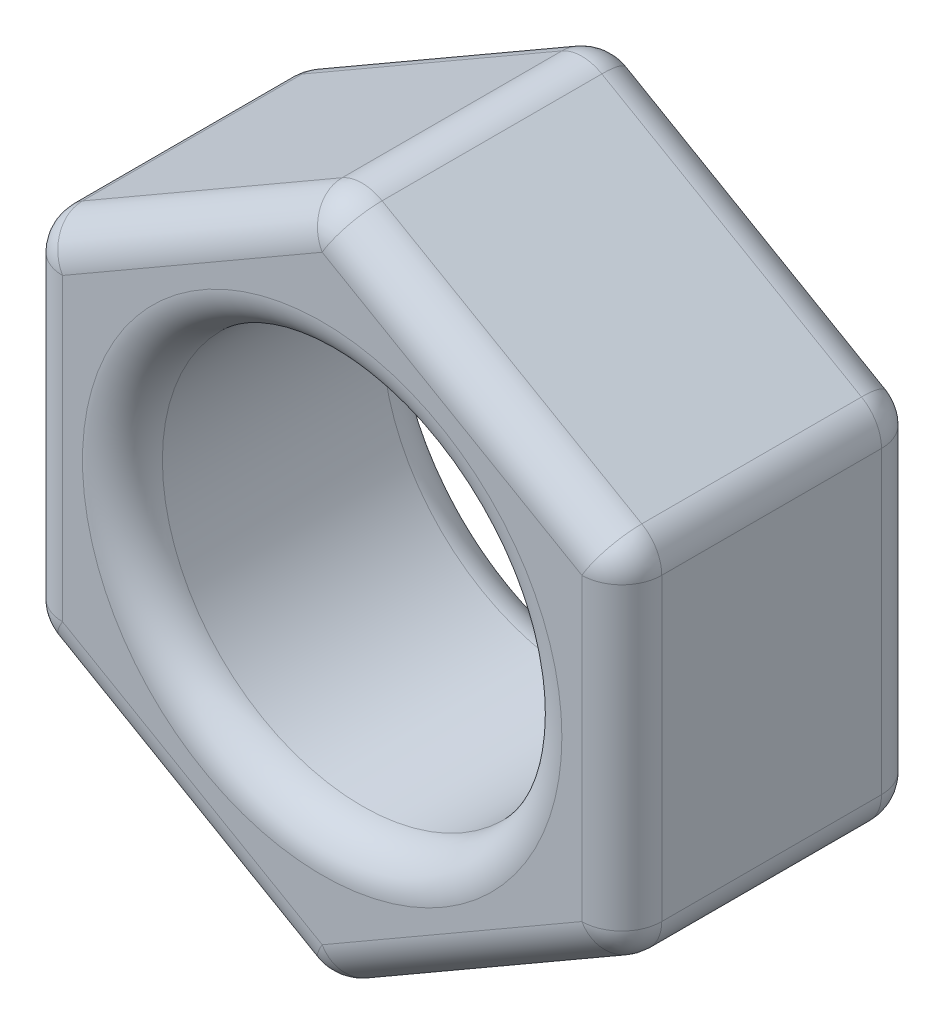
ISO-10303-21;
HEADER;
FILE_DESCRIPTION(('STEP AP214'),'2;1');
FILE_NAME('part.step','',(''),(''),'','','');
FILE_SCHEMA(('AUTOMOTIVE_DESIGN { 1 0 10303 214 1 1 1 1 }'));
ENDSEC;
DATA;
#1=APPLICATION_CONTEXT('core data for automotive mechanical design processes');
#2=APPLICATION_PROTOCOL_DEFINITION('international standard','automotive_design',2000,#1);
#3=PRODUCT_CONTEXT('',#1,'mechanical');
#4=PRODUCT('Part','Part','',(#3));
#5=PRODUCT_RELATED_PRODUCT_CATEGORY('part','',(#4));
#6=PRODUCT_DEFINITION_FORMATION('','',#4);
#7=PRODUCT_DEFINITION_CONTEXT('part definition',#1,'design');
#8=PRODUCT_DEFINITION('design','',#6,#7);
#9=PRODUCT_DEFINITION_SHAPE('','',#8);
#10=(LENGTH_UNIT() NAMED_UNIT(*) SI_UNIT(.MILLI.,.METRE.));
#11=(NAMED_UNIT(*) PLANE_ANGLE_UNIT() SI_UNIT($,.RADIAN.));
#12=(NAMED_UNIT(*) SI_UNIT($,.STERADIAN.) SOLID_ANGLE_UNIT());
#13=UNCERTAINTY_MEASURE_WITH_UNIT(LENGTH_MEASURE(1.E-05),#10,'distance_accuracy_value','');
#14=(GEOMETRIC_REPRESENTATION_CONTEXT(3) GLOBAL_UNCERTAINTY_ASSIGNED_CONTEXT((#13)) GLOBAL_UNIT_ASSIGNED_CONTEXT((#10,
#11,#12)) REPRESENTATION_CONTEXT('',''));
#15=CARTESIAN_POINT('',(0.,0.,0.));
#16=DIRECTION('',(0.,0.,1.));
#17=DIRECTION('',(1.,0.,0.));
#18=AXIS2_PLACEMENT_3D('',#15,#16,#17);
#19=CARTESIAN_POINT('',(0.,-1.73205080756889,1.5));
#20=DIRECTION('',(0.,0.,1.));
#21=DIRECTION('',(1.,0.,0.));
#22=AXIS2_PLACEMENT_3D('',#19,#20,#21);
#23=PLANE('',#22);
#24=DIRECTION('',(-0.866025403784439,0.5,0.));
#25=VECTOR('',#24,1.);
#26=CARTESIAN_POINT('',(-0.0999999999999946,1.55884572681201,1.5));
#27=LINE('',#26,#25);
#28=CARTESIAN_POINT('',(1.30000000000001,0.750555349946526,1.5));
#29=VERTEX_POINT('',#28);
#30=CARTESIAN_POINT('',(0.,1.50111069989304,1.5));
#31=VERTEX_POINT('',#30);
#32=EDGE_CURVE('E204',#29,#31,#27,.T.);
#33=ORIENTED_EDGE('',*,*,#32,.T.);
#34=DIRECTION('',(-0.866025403784439,-0.5,0.));
#35=VECTOR('',#34,1.);
#36=CARTESIAN_POINT('',(-1.40000000000001,0.692820323027558,1.5));
#37=LINE('',#36,#35);
#38=CARTESIAN_POINT('',(-1.30000000000001,0.75055534994652,1.5));
#39=VERTEX_POINT('',#38);
#40=EDGE_CURVE('E176',#31,#39,#37,.T.);
#41=ORIENTED_EDGE('',*,*,#40,.T.);
#42=DIRECTION('',(0.,-1.,0.));
#43=VECTOR('',#42,1.);
#44=CARTESIAN_POINT('',(-1.30000000000001,-0.866025403784445,1.5));
#45=LINE('',#44,#43);
#46=CARTESIAN_POINT('',(-1.30000000000001,-0.75055534994652,1.5));
#47=VERTEX_POINT('',#46);
#48=EDGE_CURVE('E193',#39,#47,#45,.T.);
#49=ORIENTED_EDGE('',*,*,#48,.T.);
#50=DIRECTION('',(0.866025403784439,-0.5,0.));
#51=VECTOR('',#50,1.);
#52=CARTESIAN_POINT('',(0.1,-1.55884572681201,1.5));
#53=LINE('',#52,#51);
#54=CARTESIAN_POINT('',(0.,-1.50111069989304,1.5));
#55=VERTEX_POINT('',#54);
#56=EDGE_CURVE('E199',#47,#55,#53,.T.);
#57=ORIENTED_EDGE('',*,*,#56,.T.);
#58=DIRECTION('',(0.866025403784439,0.5,0.));
#59=VECTOR('',#58,1.);
#60=CARTESIAN_POINT('',(1.40000000000002,-0.692820323027558,1.5));
#61=LINE('',#60,#59);
#62=CARTESIAN_POINT('',(1.30000000000001,-0.750555349946521,1.5));
#63=VERTEX_POINT('',#62);
#64=EDGE_CURVE('E376',#55,#63,#61,.T.);
#65=ORIENTED_EDGE('',*,*,#64,.T.);
#66=DIRECTION('',(0.,1.,0.));
#67=VECTOR('',#66,1.);
#68=CARTESIAN_POINT('',(1.30000000000001,0.866025403784451,1.5));
#69=LINE('',#68,#67);
#70=EDGE_CURVE('E210',#63,#29,#69,.T.);
#71=ORIENTED_EDGE('',*,*,#70,.T.);
#72=EDGE_LOOP('',(#33,#41,#49,#57,#65,#71));
#73=FACE_BOUND('',#72,.T.);
#74=CARTESIAN_POINT('',(0.,0.,1.5));
#75=DIRECTION('',(0.,0.,1.));
#76=DIRECTION('',(1.,0.,0.));
#77=AXIS2_PLACEMENT_3D('',#74,#75,#76);
#78=CIRCLE('',#77,1.2);
#79=CARTESIAN_POINT('',(1.2,0.,1.5));
#80=VERTEX_POINT('',#79);
#81=EDGE_CURVE('E200',#80,#80,#78,.F.);
#82=ORIENTED_EDGE('',*,*,#81,.T.);
#83=EDGE_LOOP('',(#82));
#84=FACE_BOUND('',#83,.T.);
#85=ADVANCED_FACE('F44',(#73,#84),#23,.T.);
#86=CARTESIAN_POINT('',(0.,-1.73205080756889,0.));
#87=DIRECTION('',(0.,0.,1.));
#88=DIRECTION('',(1.,0.,0.));
#89=AXIS2_PLACEMENT_3D('',#86,#87,#88);
#90=PLANE('',#89);
#91=DIRECTION('',(0.,-1.,0.));
#92=VECTOR('',#91,1.);
#93=CARTESIAN_POINT('',(-1.30000000000001,-1.73205080756889,0.));
#94=LINE('',#93,#92);
#95=CARTESIAN_POINT('',(-1.30000000000001,-0.75055534994652,0.));
#96=VERTEX_POINT('',#95);
#97=CARTESIAN_POINT('',(-1.30000000000001,0.75055534994652,0.));
#98=VERTEX_POINT('',#97);
#99=EDGE_CURVE('E221',#96,#98,#94,.F.);
#100=ORIENTED_EDGE('',*,*,#99,.T.);
#101=DIRECTION('',(-0.866025403784439,-0.5,0.));
#102=VECTOR('',#101,1.);
#103=CARTESIAN_POINT('',(-1.40000000000001,0.692820323027559,0.));
#104=LINE('',#103,#102);
#105=CARTESIAN_POINT('',(0.,1.50111069989304,0.));
#106=VERTEX_POINT('',#105);
#107=EDGE_CURVE('E231',#98,#106,#104,.F.);
#108=ORIENTED_EDGE('',*,*,#107,.T.);
#109=DIRECTION('',(-0.866025403784439,0.5,0.));
#110=VECTOR('',#109,1.);
#111=CARTESIAN_POINT('',(1.40000000000002,0.692820323027562,0.));
#112=LINE('',#111,#110);
#113=CARTESIAN_POINT('',(1.30000000000001,0.750555349946525,0.));
#114=VERTEX_POINT('',#113);
#115=EDGE_CURVE('E229',#106,#114,#112,.F.);
#116=ORIENTED_EDGE('',*,*,#115,.T.);
#117=DIRECTION('',(0.,1.,0.));
#118=VECTOR('',#117,1.);
#119=CARTESIAN_POINT('',(1.30000000000002,-1.73205080756889,0.));
#120=LINE('',#119,#118);
#121=CARTESIAN_POINT('',(1.30000000000001,-0.750555349946521,0.));
#122=VERTEX_POINT('',#121);
#123=EDGE_CURVE('E227',#114,#122,#120,.F.);
#124=ORIENTED_EDGE('',*,*,#123,.T.);
#125=DIRECTION('',(0.866025403784439,0.5,0.));
#126=VECTOR('',#125,1.);
#127=CARTESIAN_POINT('',(-0.1,-1.55884572681201,0.));
#128=LINE('',#127,#126);
#129=CARTESIAN_POINT('',(0.,-1.50111069989304,0.));
#130=VERTEX_POINT('',#129);
#131=EDGE_CURVE('E225',#122,#130,#128,.F.);
#132=ORIENTED_EDGE('',*,*,#131,.T.);
#133=DIRECTION('',(0.866025403784439,-0.5,0.));
#134=VECTOR('',#133,1.);
#135=CARTESIAN_POINT('',(0.0999999999999999,-1.55884572681201,0.));
#136=LINE('',#135,#134);
#137=EDGE_CURVE('E223',#130,#96,#136,.F.);
#138=ORIENTED_EDGE('',*,*,#137,.T.);
#139=EDGE_LOOP('',(#100,#108,#116,#124,#132,#138));
#140=FACE_BOUND('',#139,.T.);
#141=CARTESIAN_POINT('',(0.,0.,0.));
#142=DIRECTION('',(0.,0.,1.));
#143=DIRECTION('',(1.,0.,0.));
#144=AXIS2_PLACEMENT_3D('',#141,#142,#143);
#145=CIRCLE('',#144,1.2);
#146=CARTESIAN_POINT('',(1.2,0.,0.));
#147=VERTEX_POINT('',#146);
#148=EDGE_CURVE('E218',#147,#147,#145,.T.);
#149=ORIENTED_EDGE('',*,*,#148,.T.);
#150=EDGE_LOOP('',(#149));
#151=FACE_BOUND('',#150,.T.);
#152=ADVANCED_FACE('F464',(#140,#151),#90,.F.);
#153=CARTESIAN_POINT('',(-1.50000000000001,-0.866025403784445,1.5));
#154=DIRECTION('',(0.5,0.866025403784438,0.));
#155=DIRECTION('',(-0.866025403784439,0.5,0.));
#156=AXIS2_PLACEMENT_3D('',#153,#154,#155);
#157=PLANE('',#156);
#158=DIRECTION('',(0.,0.,-1.));
#159=VECTOR('',#158,1.);
#160=CARTESIAN_POINT('',(-0.0999999999999998,-1.67431578064993,1.5));
#161=LINE('',#160,#159);
#162=CARTESIAN_POINT('',(-0.1,-1.67431578064993,0.2));
#163=VERTEX_POINT('',#162);
#164=CARTESIAN_POINT('',(-0.1,-1.67431578064993,1.3));
#165=VERTEX_POINT('',#164);
#166=EDGE_CURVE('E265',#163,#165,#161,.F.);
#167=ORIENTED_EDGE('',*,*,#166,.T.);
#168=DIRECTION('',(0.866025403784439,-0.5,0.));
#169=VECTOR('',#168,1.);
#170=CARTESIAN_POINT('',(-1.50000000000001,-0.866025403784445,1.3));
#171=LINE('',#170,#169);
#172=CARTESIAN_POINT('',(-1.40000000000001,-0.923760430703408,1.3));
#173=VERTEX_POINT('',#172);
#174=EDGE_CURVE('E267',#165,#173,#171,.F.);
#175=ORIENTED_EDGE('',*,*,#174,.T.);
#176=DIRECTION('',(0.,0.,-1.));
#177=VECTOR('',#176,1.);
#178=CARTESIAN_POINT('',(-1.40000000000001,-0.923760430703408,1.5));
#179=LINE('',#178,#177);
#180=CARTESIAN_POINT('',(-1.40000000000001,-0.923760430703408,0.2));
#181=VERTEX_POINT('',#180);
#182=EDGE_CURVE('E261',#173,#181,#179,.T.);
#183=ORIENTED_EDGE('',*,*,#182,.T.);
#184=DIRECTION('',(0.866025403784439,-0.5,0.));
#185=VECTOR('',#184,1.);
#186=CARTESIAN_POINT('',(-1.50000000000001,-0.866025403784445,0.2));
#187=LINE('',#186,#185);
#188=EDGE_CURVE('E263',#181,#163,#187,.T.);
#189=ORIENTED_EDGE('',*,*,#188,.T.);
#190=EDGE_LOOP('',(#167,#175,#183,#189));
#191=FACE_BOUND('',#190,.T.);
#192=ADVANCED_FACE('F469',(#191),#157,.F.);
#193=CARTESIAN_POINT('',(0.,-1.73205080756889,1.5));
#194=DIRECTION('',(-0.5,0.866025403784439,0.));
#195=DIRECTION('',(-0.866025403784439,-0.5,0.));
#196=AXIS2_PLACEMENT_3D('',#193,#194,#195);
#197=PLANE('',#196);
#198=DIRECTION('',(0.,0.,-1.));
#199=VECTOR('',#198,1.);
#200=CARTESIAN_POINT('',(1.40000000000001,-0.923760430703409,1.5));
#201=LINE('',#200,#199);
#202=CARTESIAN_POINT('',(1.40000000000001,-0.923760430703409,0.2));
#203=VERTEX_POINT('',#202);
#204=CARTESIAN_POINT('',(1.40000000000001,-0.923760430703409,1.3));
#205=VERTEX_POINT('',#204);
#206=EDGE_CURVE('E256',#203,#205,#201,.F.);
#207=ORIENTED_EDGE('',*,*,#206,.T.);
#208=DIRECTION('',(0.866025403784439,0.5,0.));
#209=VECTOR('',#208,1.);
#210=CARTESIAN_POINT('',(0.,-1.73205080756889,1.3));
#211=LINE('',#210,#209);
#212=CARTESIAN_POINT('',(0.0999999999999999,-1.67431578064993,1.3));
#213=VERTEX_POINT('',#212);
#214=EDGE_CURVE('E258',#205,#213,#211,.F.);
#215=ORIENTED_EDGE('',*,*,#214,.T.);
#216=DIRECTION('',(0.,0.,-1.));
#217=VECTOR('',#216,1.);
#218=CARTESIAN_POINT('',(0.0999999999999999,-1.67431578064993,1.5));
#219=LINE('',#218,#217);
#220=CARTESIAN_POINT('',(0.0999999999999999,-1.67431578064993,0.2));
#221=VERTEX_POINT('',#220);
#222=EDGE_CURVE('E252',#213,#221,#219,.T.);
#223=ORIENTED_EDGE('',*,*,#222,.T.);
#224=DIRECTION('',(0.866025403784439,0.5,0.));
#225=VECTOR('',#224,1.);
#226=CARTESIAN_POINT('',(0.,-1.73205080756889,0.2));
#227=LINE('',#226,#225);
#228=EDGE_CURVE('E254',#221,#203,#227,.T.);
#229=ORIENTED_EDGE('',*,*,#228,.T.);
#230=EDGE_LOOP('',(#207,#215,#223,#229));
#231=FACE_BOUND('',#230,.T.);
#232=ADVANCED_FACE('F444',(#231),#197,.F.);
#233=CARTESIAN_POINT('',(1.50000000000002,-0.866025403784446,1.5));
#234=DIRECTION('',(-1.,0.,0.));
#235=DIRECTION('',(0.,-1.,0.));
#236=AXIS2_PLACEMENT_3D('',#233,#234,#235);
#237=PLANE('',#236);
#238=DIRECTION('',(0.,0.,-1.));
#239=VECTOR('',#238,1.);
#240=CARTESIAN_POINT('',(1.50000000000001,0.750555349946526,1.5));
#241=LINE('',#240,#239);
#242=CARTESIAN_POINT('',(1.50000000000001,0.750555349946526,0.2));
#243=VERTEX_POINT('',#242);
#244=CARTESIAN_POINT('',(1.50000000000001,0.750555349946526,1.3));
#245=VERTEX_POINT('',#244);
#246=EDGE_CURVE('E247',#243,#245,#241,.F.);
#247=ORIENTED_EDGE('',*,*,#246,.T.);
#248=DIRECTION('',(0.,1.,0.));
#249=VECTOR('',#248,1.);
#250=CARTESIAN_POINT('',(1.50000000000002,-0.866025403784446,1.3));
#251=LINE('',#250,#249);
#252=CARTESIAN_POINT('',(1.50000000000002,-0.750555349946521,1.3));
#253=VERTEX_POINT('',#252);
#254=EDGE_CURVE('E249',#245,#253,#251,.F.);
#255=ORIENTED_EDGE('',*,*,#254,.T.);
#256=DIRECTION('',(0.,0.,-1.));
#257=VECTOR('',#256,1.);
#258=CARTESIAN_POINT('',(1.50000000000002,-0.750555349946521,1.5));
#259=LINE('',#258,#257);
#260=CARTESIAN_POINT('',(1.50000000000002,-0.750555349946521,0.2));
#261=VERTEX_POINT('',#260);
#262=EDGE_CURVE('E243',#253,#261,#259,.T.);
#263=ORIENTED_EDGE('',*,*,#262,.T.);
#264=DIRECTION('',(0.,1.,0.));
#265=VECTOR('',#264,1.);
#266=CARTESIAN_POINT('',(1.50000000000002,-0.866025403784446,0.2));
#267=LINE('',#266,#265);
#268=EDGE_CURVE('E245',#261,#243,#267,.T.);
#269=ORIENTED_EDGE('',*,*,#268,.T.);
#270=EDGE_LOOP('',(#247,#255,#263,#269));
#271=FACE_BOUND('',#270,.T.);
#272=ADVANCED_FACE('F482',(#271),#237,.F.);
#273=CARTESIAN_POINT('',(1.50000000000001,0.866025403784451,1.5));
#274=DIRECTION('',(-0.5,-0.866025403784439,0.));
#275=DIRECTION('',(0.866025403784439,-0.5,0.));
#276=AXIS2_PLACEMENT_3D('',#273,#274,#275);
#277=PLANE('',#276);
#278=DIRECTION('',(0.,0.,-1.));
#279=VECTOR('',#278,1.);
#280=CARTESIAN_POINT('',(0.100000000000005,1.67431578064993,1.5));
#281=LINE('',#280,#279);
#282=CARTESIAN_POINT('',(0.100000000000005,1.67431578064993,0.2));
#283=VERTEX_POINT('',#282);
#284=CARTESIAN_POINT('',(0.100000000000005,1.67431578064993,1.3));
#285=VERTEX_POINT('',#284);
#286=EDGE_CURVE('E238',#283,#285,#281,.F.);
#287=ORIENTED_EDGE('',*,*,#286,.T.);
#288=DIRECTION('',(-0.866025403784439,0.5,0.));
#289=VECTOR('',#288,1.);
#290=CARTESIAN_POINT('',(1.50000000000001,0.866025403784451,1.3));
#291=LINE('',#290,#289);
#292=CARTESIAN_POINT('',(1.40000000000001,0.923760430703413,1.3));
#293=VERTEX_POINT('',#292);
#294=EDGE_CURVE('E240',#285,#293,#291,.F.);
#295=ORIENTED_EDGE('',*,*,#294,.T.);
#296=DIRECTION('',(0.,0.,-1.));
#297=VECTOR('',#296,1.);
#298=CARTESIAN_POINT('',(1.40000000000001,0.923760430703413,1.5));
#299=LINE('',#298,#297);
#300=CARTESIAN_POINT('',(1.40000000000001,0.923760430703413,0.2));
#301=VERTEX_POINT('',#300);
#302=EDGE_CURVE('E234',#293,#301,#299,.T.);
#303=ORIENTED_EDGE('',*,*,#302,.T.);
#304=DIRECTION('',(-0.866025403784439,0.5,0.));
#305=VECTOR('',#304,1.);
#306=CARTESIAN_POINT('',(1.50000000000001,0.866025403784451,0.2));
#307=LINE('',#306,#305);
#308=EDGE_CURVE('E236',#301,#283,#307,.T.);
#309=ORIENTED_EDGE('',*,*,#308,.T.);
#310=EDGE_LOOP('',(#287,#295,#303,#309));
#311=FACE_BOUND('',#310,.T.);
#312=ADVANCED_FACE('F479',(#311),#277,.F.);
#313=CARTESIAN_POINT('',(0.,1.73205080756889,1.5));
#314=DIRECTION('',(0.5,-0.866025403784439,0.));
#315=DIRECTION('',(0.866025403784439,0.5,0.));
#316=AXIS2_PLACEMENT_3D('',#313,#314,#315);
#317=PLANE('',#316);
#318=DIRECTION('',(-0.866025403784439,-0.5,0.));
#319=VECTOR('',#318,1.);
#320=CARTESIAN_POINT('',(0.,1.73205080756889,1.3));
#321=LINE('',#320,#319);
#322=CARTESIAN_POINT('',(-1.40000000000001,0.923760430703408,1.3));
#323=VERTEX_POINT('',#322);
#324=CARTESIAN_POINT('',(-0.0999999999999947,1.67431578064993,1.3));
#325=VERTEX_POINT('',#324);
#326=EDGE_CURVE('E178',#323,#325,#321,.F.);
#327=ORIENTED_EDGE('',*,*,#326,.T.);
#328=DIRECTION('',(0.,0.,-1.));
#329=VECTOR('',#328,1.);
#330=CARTESIAN_POINT('',(-0.0999999999999947,1.67431578064993,1.5));
#331=LINE('',#330,#329);
#332=CARTESIAN_POINT('',(-0.0999999999999947,1.67431578064993,0.2));
#333=VERTEX_POINT('',#332);
#334=EDGE_CURVE('E216',#325,#333,#331,.T.);
#335=ORIENTED_EDGE('',*,*,#334,.T.);
#336=DIRECTION('',(-0.866025403784439,-0.5,0.));
#337=VECTOR('',#336,1.);
#338=CARTESIAN_POINT('',(0.,1.73205080756889,0.2));
#339=LINE('',#338,#337);
#340=CARTESIAN_POINT('',(-1.40000000000001,0.923760430703408,0.2));
#341=VERTEX_POINT('',#340);
#342=EDGE_CURVE('E208',#333,#341,#339,.T.);
#343=ORIENTED_EDGE('',*,*,#342,.T.);
#344=DIRECTION('',(0.,0.,-1.));
#345=VECTOR('',#344,1.);
#346=CARTESIAN_POINT('',(-1.40000000000001,0.923760430703408,1.5));
#347=LINE('',#346,#345);
#348=EDGE_CURVE('E206',#341,#323,#347,.F.);
#349=ORIENTED_EDGE('',*,*,#348,.T.);
#350=EDGE_LOOP('',(#327,#335,#343,#349));
#351=FACE_BOUND('',#350,.T.);
#352=ADVANCED_FACE('F403',(#351),#317,.F.);
#353=CARTESIAN_POINT('',(-1.50000000000001,0.866025403784445,1.5));
#354=DIRECTION('',(1.,0.,0.));
#355=DIRECTION('',(0.,0.,-1.));
#356=AXIS2_PLACEMENT_3D('',#353,#354,#355);
#357=PLANE('',#356);
#358=DIRECTION('',(0.,-1.,0.));
#359=VECTOR('',#358,1.);
#360=CARTESIAN_POINT('',(-1.50000000000001,0.866025403784445,1.3));
#361=LINE('',#360,#359);
#362=CARTESIAN_POINT('',(-1.50000000000001,-0.75055534994652,1.3));
#363=VERTEX_POINT('',#362);
#364=CARTESIAN_POINT('',(-1.50000000000001,0.75055534994652,1.3));
#365=VERTEX_POINT('',#364);
#366=EDGE_CURVE('E61',#363,#365,#361,.F.);
#367=ORIENTED_EDGE('',*,*,#366,.T.);
#368=DIRECTION('',(0.,0.,-1.));
#369=VECTOR('',#368,1.);
#370=CARTESIAN_POINT('',(-1.50000000000001,0.75055534994652,1.5));
#371=LINE('',#370,#369);
#372=CARTESIAN_POINT('',(-1.50000000000001,0.75055534994652,0.2));
#373=VERTEX_POINT('',#372);
#374=EDGE_CURVE('E274',#365,#373,#371,.T.);
#375=ORIENTED_EDGE('',*,*,#374,.T.);
#376=DIRECTION('',(0.,-1.,0.));
#377=VECTOR('',#376,1.);
#378=CARTESIAN_POINT('',(-1.50000000000001,0.866025403784445,0.2));
#379=LINE('',#378,#377);
#380=CARTESIAN_POINT('',(-1.50000000000001,-0.75055534994652,0.2));
#381=VERTEX_POINT('',#380);
#382=EDGE_CURVE('E270',#373,#381,#379,.T.);
#383=ORIENTED_EDGE('',*,*,#382,.T.);
#384=DIRECTION('',(0.,0.,-1.));
#385=VECTOR('',#384,1.);
#386=CARTESIAN_POINT('',(-1.50000000000001,-0.750555349946521,1.5));
#387=LINE('',#386,#385);
#388=EDGE_CURVE('E66',#381,#363,#387,.F.);
#389=ORIENTED_EDGE('',*,*,#388,.T.);
#390=EDGE_LOOP('',(#367,#375,#383,#389));
#391=FACE_BOUND('',#390,.T.);
#392=ADVANCED_FACE('F409',(#391),#357,.F.);
#393=CARTESIAN_POINT('',(0.,0.,1.5));
#394=DIRECTION('',(0.,0.,-1.));
#395=DIRECTION('',(-1.,0.,0.));
#396=AXIS2_PLACEMENT_3D('',#393,#394,#395);
#397=CYLINDRICAL_SURFACE('',#396,1.);
#398=CARTESIAN_POINT('',(0.,0.,0.2));
#399=DIRECTION('',(0.,0.,1.));
#400=DIRECTION('',(1.,0.,0.));
#401=AXIS2_PLACEMENT_3D('',#398,#399,#400);
#402=CIRCLE('',#401,1.);
#403=CARTESIAN_POINT('',(1.,0.,0.2));
#404=VERTEX_POINT('',#403);
#405=EDGE_CURVE('E13',#404,#404,#402,.F.);
#406=ORIENTED_EDGE('',*,*,#405,.T.);
#407=EDGE_LOOP('',(#406));
#408=FACE_BOUND('',#407,.T.);
#409=CARTESIAN_POINT('',(0.,0.,1.3));
#410=DIRECTION('',(0.,0.,1.));
#411=DIRECTION('',(1.,0.,0.));
#412=AXIS2_PLACEMENT_3D('',#409,#410,#411);
#413=CIRCLE('',#412,1.);
#414=CARTESIAN_POINT('',(1.,0.,1.3));
#415=VERTEX_POINT('',#414);
#416=EDGE_CURVE('E53',#415,#415,#413,.T.);
#417=ORIENTED_EDGE('',*,*,#416,.T.);
#418=EDGE_LOOP('',(#417));
#419=FACE_BOUND('',#418,.T.);
#420=ADVANCED_FACE('F473',(#408,#419),#397,.F.);
#421=CARTESIAN_POINT('',(-0.0999999999999999,-1.558845726812,0.2));
#422=DIRECTION('',(0.866025403784439,0.5,0.));
#423=DIRECTION('',(-0.5,0.866025403784439,0.));
#424=AXIS2_PLACEMENT_3D('',#421,#422,#423);
#425=CYLINDRICAL_SURFACE('',#424,0.2);
#426=CARTESIAN_POINT('',(1.30000000000001,-0.750555349946521,0.2));
#427=DIRECTION('',(0.866025403784439,0.499999999999999,0.));
#428=DIRECTION('',(-0.499999999999999,0.866025403784439,0.));
#429=AXIS2_PLACEMENT_3D('',#426,#427,#428);
#430=CIRCLE('',#429,0.2);
#431=EDGE_CURVE('E48',#203,#122,#430,.T.);
#432=ORIENTED_EDGE('',*,*,#431,.F.);
#433=ORIENTED_EDGE('',*,*,#228,.F.);
#434=CARTESIAN_POINT('',(0.,-1.50111069989304,0.2));
#435=DIRECTION('',(-0.866025403784439,-0.499999999999999,0.));
#436=DIRECTION('',(0.499999999999999,-0.866025403784439,0.));
#437=AXIS2_PLACEMENT_3D('',#434,#435,#436);
#438=CIRCLE('',#437,0.2);
#439=EDGE_CURVE('E360',#130,#221,#438,.T.);
#440=ORIENTED_EDGE('',*,*,#439,.F.);
#441=ORIENTED_EDGE('',*,*,#131,.F.);
#442=EDGE_LOOP('',(#432,#433,#440,#441));
#443=FACE_BOUND('',#442,.T.);
#444=ADVANCED_FACE('F738',(#443),#425,.T.);
#445=CARTESIAN_POINT('',(1.30000000000001,-0.750555349946521,0.2));
#446=DIRECTION('',(0.,0.,1.));
#447=DIRECTION('',(1.,0.,0.));
#448=AXIS2_PLACEMENT_3D('',#445,#446,#447);
#449=SPHERICAL_SURFACE('',#448,0.2);
#450=CARTESIAN_POINT('',(1.30000000000001,-0.750555349946521,0.2));
#451=DIRECTION('',(0.,0.,-1.));
#452=DIRECTION('',(-1.,0.,0.));
#453=AXIS2_PLACEMENT_3D('',#450,#451,#452);
#454=CIRCLE('',#453,0.2);
#455=EDGE_CURVE('E355',#203,#261,#454,.F.);
#456=ORIENTED_EDGE('',*,*,#455,.F.);
#457=ORIENTED_EDGE('',*,*,#431,.T.);
#458=CARTESIAN_POINT('',(1.30000000000001,-0.750555349946521,0.2));
#459=DIRECTION('',(0.,-1.,0.));
#460=DIRECTION('',(1.,0.,0.));
#461=AXIS2_PLACEMENT_3D('',#458,#459,#460);
#462=CIRCLE('',#461,0.2);
#463=EDGE_CURVE('E358',#261,#122,#462,.F.);
#464=ORIENTED_EDGE('',*,*,#463,.F.);
#465=EDGE_LOOP('',(#456,#457,#464));
#466=FACE_BOUND('',#465,.T.);
#467=ADVANCED_FACE('F730',(#466),#449,.T.);
#468=CARTESIAN_POINT('',(0.,-1.50111069989304,0.2));
#469=DIRECTION('',(0.,0.,1.));
#470=DIRECTION('',(1.,0.,0.));
#471=AXIS2_PLACEMENT_3D('',#468,#469,#470);
#472=SPHERICAL_SURFACE('',#471,0.2);
#473=CARTESIAN_POINT('',(0.,-1.50111069989304,0.2));
#474=DIRECTION('',(0.866025403784438,-0.5,0.));
#475=DIRECTION('',(0.5,0.866025403784438,0.));
#476=AXIS2_PLACEMENT_3D('',#473,#474,#475);
#477=CIRCLE('',#476,0.2);
#478=EDGE_CURVE('E349',#130,#163,#477,.F.);
#479=ORIENTED_EDGE('',*,*,#478,.F.);
#480=ORIENTED_EDGE('',*,*,#439,.T.);
#481=CARTESIAN_POINT('',(0.,-1.50111069989304,0.2));
#482=DIRECTION('',(0.,0.,-1.));
#483=DIRECTION('',(-1.,0.,0.));
#484=AXIS2_PLACEMENT_3D('',#481,#482,#483);
#485=CIRCLE('',#484,0.2);
#486=EDGE_CURVE('E352',#163,#221,#485,.F.);
#487=ORIENTED_EDGE('',*,*,#486,.F.);
#488=EDGE_LOOP('',(#479,#480,#487));
#489=FACE_BOUND('',#488,.T.);
#490=ADVANCED_FACE('F721',(#489),#472,.T.);
#491=CARTESIAN_POINT('',(1.30000000000002,-0.866025403784446,0.2));
#492=DIRECTION('',(0.,1.,0.));
#493=DIRECTION('',(-1.,0.,0.));
#494=AXIS2_PLACEMENT_3D('',#491,#492,#493);
#495=CYLINDRICAL_SURFACE('',#494,0.2);
#496=ORIENTED_EDGE('',*,*,#463,.T.);
#497=ORIENTED_EDGE('',*,*,#123,.F.);
#498=CARTESIAN_POINT('',(1.30000000000001,0.750555349946525,0.2));
#499=DIRECTION('',(0.,1.,0.));
#500=DIRECTION('',(-1.,0.,0.));
#501=AXIS2_PLACEMENT_3D('',#498,#499,#500);
#502=CIRCLE('',#501,0.2);
#503=EDGE_CURVE('E346',#243,#114,#502,.T.);
#504=ORIENTED_EDGE('',*,*,#503,.F.);
#505=ORIENTED_EDGE('',*,*,#268,.F.);
#506=EDGE_LOOP('',(#496,#497,#504,#505));
#507=FACE_BOUND('',#506,.T.);
#508=ADVANCED_FACE('F713',(#507),#495,.T.);
#509=CARTESIAN_POINT('',(1.30000000000001,-0.750555349946521,1.5));
#510=DIRECTION('',(0.,0.,-1.));
#511=DIRECTION('',(-1.,0.,0.));
#512=AXIS2_PLACEMENT_3D('',#509,#510,#511);
#513=CYLINDRICAL_SURFACE('',#512,0.2);
#514=ORIENTED_EDGE('',*,*,#455,.T.);
#515=ORIENTED_EDGE('',*,*,#262,.F.);
#516=CARTESIAN_POINT('',(1.30000000000001,-0.750555349946521,1.3));
#517=DIRECTION('',(0.,0.,1.));
#518=DIRECTION('',(1.,0.,0.));
#519=AXIS2_PLACEMENT_3D('',#516,#517,#518);
#520=CIRCLE('',#519,0.2);
#521=EDGE_CURVE('E343',#205,#253,#520,.T.);
#522=ORIENTED_EDGE('',*,*,#521,.F.);
#523=ORIENTED_EDGE('',*,*,#206,.F.);
#524=EDGE_LOOP('',(#514,#515,#522,#523));
#525=FACE_BOUND('',#524,.T.);
#526=ADVANCED_FACE('F449',(#525),#513,.T.);
#527=CARTESIAN_POINT('',(-0.1,-1.55884572681201,1.3));
#528=DIRECTION('',(-0.866025403784439,-0.5,0.));
#529=DIRECTION('',(0.5,-0.866025403784439,0.));
#530=AXIS2_PLACEMENT_3D('',#527,#528,#529);
#531=CYLINDRICAL_SURFACE('',#530,0.2);
#532=CARTESIAN_POINT('',(0.,-1.50111069989304,1.3));
#533=DIRECTION('',(-0.866025403784439,-0.5,0.));
#534=DIRECTION('',(0.5,-0.866025403784439,0.));
#535=AXIS2_PLACEMENT_3D('',#532,#533,#534);
#536=CIRCLE('',#535,0.2);
#537=EDGE_CURVE('E337',#213,#55,#536,.T.);
#538=ORIENTED_EDGE('',*,*,#537,.F.);
#539=ORIENTED_EDGE('',*,*,#214,.F.);
#540=CARTESIAN_POINT('',(1.30000000000001,-0.750555349946521,1.3));
#541=DIRECTION('',(0.866025403784439,0.499999999999999,0.));
#542=DIRECTION('',(-0.499999999999999,0.866025403784439,0.));
#543=AXIS2_PLACEMENT_3D('',#540,#541,#542);
#544=CIRCLE('',#543,0.2);
#545=EDGE_CURVE('E340',#63,#205,#544,.T.);
#546=ORIENTED_EDGE('',*,*,#545,.F.);
#547=ORIENTED_EDGE('',*,*,#64,.F.);
#548=EDGE_LOOP('',(#538,#539,#546,#547));
#549=FACE_BOUND('',#548,.T.);
#550=ADVANCED_FACE('F432',(#549),#531,.T.);
#551=CARTESIAN_POINT('',(0.,-1.50111069989304,1.5));
#552=DIRECTION('',(0.,0.,-1.));
#553=DIRECTION('',(-1.,0.,0.));
#554=AXIS2_PLACEMENT_3D('',#551,#552,#553);
#555=CYLINDRICAL_SURFACE('',#554,0.2);
#556=ORIENTED_EDGE('',*,*,#486,.T.);
#557=ORIENTED_EDGE('',*,*,#222,.F.);
#558=CARTESIAN_POINT('',(0.,-1.50111069989304,1.3));
#559=DIRECTION('',(0.,0.,1.));
#560=DIRECTION('',(1.,0.,0.));
#561=AXIS2_PLACEMENT_3D('',#558,#559,#560);
#562=CIRCLE('',#561,0.2);
#563=EDGE_CURVE('E335',#165,#213,#562,.T.);
#564=ORIENTED_EDGE('',*,*,#563,.F.);
#565=ORIENTED_EDGE('',*,*,#166,.F.);
#566=EDGE_LOOP('',(#556,#557,#564,#565));
#567=FACE_BOUND('',#566,.T.);
#568=ADVANCED_FACE('F441',(#567),#555,.T.);
#569=CARTESIAN_POINT('',(-1.40000000000001,-0.692820323027558,0.2));
#570=DIRECTION('',(0.866025403784439,-0.5,0.));
#571=DIRECTION('',(0.5,0.866025403784438,0.));
#572=AXIS2_PLACEMENT_3D('',#569,#570,#571);
#573=CYLINDRICAL_SURFACE('',#572,0.2);
#574=ORIENTED_EDGE('',*,*,#478,.T.);
#575=ORIENTED_EDGE('',*,*,#188,.F.);
#576=CARTESIAN_POINT('',(-1.30000000000001,-0.75055534994652,0.2));
#577=DIRECTION('',(-0.866025403784439,0.5,0.));
#578=DIRECTION('',(-0.5,-0.866025403784439,0.));
#579=AXIS2_PLACEMENT_3D('',#576,#577,#578);
#580=CIRCLE('',#579,0.2);
#581=EDGE_CURVE('E332',#96,#181,#580,.T.);
#582=ORIENTED_EDGE('',*,*,#581,.F.);
#583=ORIENTED_EDGE('',*,*,#137,.F.);
#584=EDGE_LOOP('',(#574,#575,#582,#583));
#585=FACE_BOUND('',#584,.T.);
#586=ADVANCED_FACE('F460',(#585),#573,.T.);
#587=CARTESIAN_POINT('',(1.30000000000001,0.750555349946525,0.2));
#588=DIRECTION('',(0.,0.,1.));
#589=DIRECTION('',(1.,0.,0.));
#590=AXIS2_PLACEMENT_3D('',#587,#588,#589);
#591=SPHERICAL_SURFACE('',#590,0.2);
#592=CARTESIAN_POINT('',(1.30000000000001,0.750555349946526,0.2));
#593=DIRECTION('',(0.,0.,-1.));
#594=DIRECTION('',(-1.,0.,0.));
#595=AXIS2_PLACEMENT_3D('',#592,#593,#594);
#596=CIRCLE('',#595,0.2);
#597=EDGE_CURVE('E326',#243,#301,#596,.F.);
#598=ORIENTED_EDGE('',*,*,#597,.F.);
#599=ORIENTED_EDGE('',*,*,#503,.T.);
#600=CARTESIAN_POINT('',(1.30000000000001,0.750555349946525,0.2));
#601=DIRECTION('',(0.866025403784439,-0.499999999999999,0.));
#602=DIRECTION('',(0.499999999999999,0.866025403784439,0.));
#603=AXIS2_PLACEMENT_3D('',#600,#601,#602);
#604=CIRCLE('',#603,0.2);
#605=EDGE_CURVE('E329',#301,#114,#604,.F.);
#606=ORIENTED_EDGE('',*,*,#605,.F.);
#607=EDGE_LOOP('',(#598,#599,#606));
#608=FACE_BOUND('',#607,.T.);
#609=ADVANCED_FACE('F453',(#608),#591,.T.);
#610=CARTESIAN_POINT('',(1.30000000000001,-0.750555349946521,1.3));
#611=DIRECTION('',(0.,0.,1.));
#612=DIRECTION('',(1.,0.,0.));
#613=AXIS2_PLACEMENT_3D('',#610,#611,#612);
#614=SPHERICAL_SURFACE('',#613,0.2);
#615=ORIENTED_EDGE('',*,*,#545,.T.);
#616=ORIENTED_EDGE('',*,*,#521,.T.);
#617=CARTESIAN_POINT('',(1.30000000000001,-0.750555349946521,1.3));
#618=DIRECTION('',(0.,-1.,0.));
#619=DIRECTION('',(1.,0.,0.));
#620=AXIS2_PLACEMENT_3D('',#617,#618,#619);
#621=CIRCLE('',#620,0.2);
#622=EDGE_CURVE('E324',#63,#253,#621,.F.);
#623=ORIENTED_EDGE('',*,*,#622,.F.);
#624=EDGE_LOOP('',(#615,#616,#623));
#625=FACE_BOUND('',#624,.T.);
#626=ADVANCED_FACE('F451',(#625),#614,.T.);
#627=CARTESIAN_POINT('',(0.,-1.50111069989304,1.3));
#628=DIRECTION('',(0.,0.,1.));
#629=DIRECTION('',(1.,0.,0.));
#630=AXIS2_PLACEMENT_3D('',#627,#628,#629);
#631=SPHERICAL_SURFACE('',#630,0.2);
#632=ORIENTED_EDGE('',*,*,#563,.T.);
#633=ORIENTED_EDGE('',*,*,#537,.T.);
#634=CARTESIAN_POINT('',(0.,-1.50111069989304,1.3));
#635=DIRECTION('',(0.866025403784438,-0.500000000000001,0.));
#636=DIRECTION('',(0.500000000000001,0.866025403784438,0.));
#637=AXIS2_PLACEMENT_3D('',#634,#635,#636);
#638=CIRCLE('',#637,0.2);
#639=EDGE_CURVE('E321',#165,#55,#638,.F.);
#640=ORIENTED_EDGE('',*,*,#639,.F.);
#641=EDGE_LOOP('',(#632,#633,#640));
#642=FACE_BOUND('',#641,.T.);
#643=ADVANCED_FACE('F437',(#642),#631,.T.);
#644=CARTESIAN_POINT('',(-1.30000000000001,-0.75055534994652,0.2));
#645=DIRECTION('',(0.,0.,1.));
#646=DIRECTION('',(1.,0.,0.));
#647=AXIS2_PLACEMENT_3D('',#644,#645,#646);
#648=SPHERICAL_SURFACE('',#647,0.2);
#649=CARTESIAN_POINT('',(-1.30000000000001,-0.75055534994652,0.2));
#650=DIRECTION('',(0.,-1.,0.));
#651=DIRECTION('',(0.,0.,-1.));
#652=AXIS2_PLACEMENT_3D('',#649,#650,#651);
#653=CIRCLE('',#652,0.2);
#654=EDGE_CURVE('E315',#96,#381,#653,.F.);
#655=ORIENTED_EDGE('',*,*,#654,.F.);
#656=ORIENTED_EDGE('',*,*,#581,.T.);
#657=CARTESIAN_POINT('',(-1.30000000000001,-0.75055534994652,0.2));
#658=DIRECTION('',(0.,0.,-1.));
#659=DIRECTION('',(-1.,0.,0.));
#660=AXIS2_PLACEMENT_3D('',#657,#658,#659);
#661=CIRCLE('',#660,0.2);
#662=EDGE_CURVE('E318',#381,#181,#661,.F.);
#663=ORIENTED_EDGE('',*,*,#662,.F.);
#664=EDGE_LOOP('',(#655,#656,#663));
#665=FACE_BOUND('',#664,.T.);
#666=ADVANCED_FACE('F418',(#665),#648,.T.);
#667=CARTESIAN_POINT('',(1.40000000000001,0.692820323027563,0.2));
#668=DIRECTION('',(-0.866025403784439,0.5,0.));
#669=DIRECTION('',(-0.5,-0.866025403784439,0.));
#670=AXIS2_PLACEMENT_3D('',#667,#668,#669);
#671=CYLINDRICAL_SURFACE('',#670,0.2);
#672=ORIENTED_EDGE('',*,*,#605,.T.);
#673=ORIENTED_EDGE('',*,*,#115,.F.);
#674=CARTESIAN_POINT('',(0.,1.50111069989304,0.2));
#675=DIRECTION('',(-0.866025403784439,0.5,0.));
#676=DIRECTION('',(-0.5,-0.866025403784439,0.));
#677=AXIS2_PLACEMENT_3D('',#674,#675,#676);
#678=CIRCLE('',#677,0.2);
#679=EDGE_CURVE('E310',#283,#106,#678,.T.);
#680=ORIENTED_EDGE('',*,*,#679,.F.);
#681=ORIENTED_EDGE('',*,*,#308,.F.);
#682=EDGE_LOOP('',(#672,#673,#680,#681));
#683=FACE_BOUND('',#682,.T.);
#684=ADVANCED_FACE('F534',(#683),#671,.T.);
#685=CARTESIAN_POINT('',(1.30000000000001,0.750555349946525,1.5));
#686=DIRECTION('',(0.,0.,-1.));
#687=DIRECTION('',(-1.,0.,0.));
#688=AXIS2_PLACEMENT_3D('',#685,#686,#687);
#689=CYLINDRICAL_SURFACE('',#688,0.2);
#690=ORIENTED_EDGE('',*,*,#597,.T.);
#691=ORIENTED_EDGE('',*,*,#302,.F.);
#692=CARTESIAN_POINT('',(1.30000000000001,0.750555349946525,1.3));
#693=DIRECTION('',(0.,0.,1.));
#694=DIRECTION('',(1.,0.,0.));
#695=AXIS2_PLACEMENT_3D('',#692,#693,#694);
#696=CIRCLE('',#695,0.2);
#697=EDGE_CURVE('E307',#245,#293,#696,.T.);
#698=ORIENTED_EDGE('',*,*,#697,.F.);
#699=ORIENTED_EDGE('',*,*,#246,.F.);
#700=EDGE_LOOP('',(#690,#691,#698,#699));
#701=FACE_BOUND('',#700,.T.);
#702=ADVANCED_FACE('F531',(#701),#689,.T.);
#703=CARTESIAN_POINT('',(1.30000000000002,-1.73205080756889,1.3));
#704=DIRECTION('',(0.,-1.,0.));
#705=DIRECTION('',(1.,0.,0.));
#706=AXIS2_PLACEMENT_3D('',#703,#704,#705);
#707=CYLINDRICAL_SURFACE('',#706,0.2);
#708=ORIENTED_EDGE('',*,*,#622,.T.);
#709=ORIENTED_EDGE('',*,*,#254,.F.);
#710=CARTESIAN_POINT('',(1.30000000000001,0.750555349946526,1.3));
#711=DIRECTION('',(0.,1.,0.));
#712=DIRECTION('',(-1.,0.,0.));
#713=AXIS2_PLACEMENT_3D('',#710,#711,#712);
#714=CIRCLE('',#713,0.2);
#715=EDGE_CURVE('E304',#29,#245,#714,.T.);
#716=ORIENTED_EDGE('',*,*,#715,.F.);
#717=ORIENTED_EDGE('',*,*,#70,.F.);
#718=EDGE_LOOP('',(#708,#709,#716,#717));
#719=FACE_BOUND('',#718,.T.);
#720=ADVANCED_FACE('F384',(#719),#707,.T.);
#721=CARTESIAN_POINT('',(0.0999999999999999,-1.55884572681201,1.3));
#722=DIRECTION('',(-0.866025403784439,0.5,0.));
#723=DIRECTION('',(-0.5,-0.866025403784438,0.));
#724=AXIS2_PLACEMENT_3D('',#721,#722,#723);
#725=CYLINDRICAL_SURFACE('',#724,0.2);
#726=ORIENTED_EDGE('',*,*,#639,.T.);
#727=ORIENTED_EDGE('',*,*,#56,.F.);
#728=CARTESIAN_POINT('',(-1.30000000000001,-0.75055534994652,1.3));
#729=DIRECTION('',(-0.866025403784439,0.5,0.));
#730=DIRECTION('',(-0.5,-0.866025403784439,0.));
#731=AXIS2_PLACEMENT_3D('',#728,#729,#730);
#732=CIRCLE('',#731,0.2);
#733=EDGE_CURVE('E301',#173,#47,#732,.T.);
#734=ORIENTED_EDGE('',*,*,#733,.F.);
#735=ORIENTED_EDGE('',*,*,#174,.F.);
#736=EDGE_LOOP('',(#726,#727,#734,#735));
#737=FACE_BOUND('',#736,.T.);
#738=ADVANCED_FACE('F428',(#737),#725,.T.);
#739=CARTESIAN_POINT('',(-1.30000000000001,-0.75055534994652,1.5));
#740=DIRECTION('',(0.,0.,-1.));
#741=DIRECTION('',(-1.,0.,0.));
#742=AXIS2_PLACEMENT_3D('',#739,#740,#741);
#743=CYLINDRICAL_SURFACE('',#742,0.2);
#744=ORIENTED_EDGE('',*,*,#662,.T.);
#745=ORIENTED_EDGE('',*,*,#182,.F.);
#746=CARTESIAN_POINT('',(-1.30000000000001,-0.75055534994652,1.3));
#747=DIRECTION('',(0.,0.,1.));
#748=DIRECTION('',(1.,0.,0.));
#749=AXIS2_PLACEMENT_3D('',#746,#747,#748);
#750=CIRCLE('',#749,0.2);
#751=EDGE_CURVE('E299',#363,#173,#750,.T.);
#752=ORIENTED_EDGE('',*,*,#751,.F.);
#753=ORIENTED_EDGE('',*,*,#388,.F.);
#754=EDGE_LOOP('',(#744,#745,#752,#753));
#755=FACE_BOUND('',#754,.T.);
#756=ADVANCED_FACE('F422',(#755),#743,.T.);
#757=CARTESIAN_POINT('',(-1.30000000000001,0.866025403784445,0.2));
#758=DIRECTION('',(0.,-1.,0.));
#759=DIRECTION('',(0.,0.,-1.));
#760=AXIS2_PLACEMENT_3D('',#757,#758,#759);
#761=CYLINDRICAL_SURFACE('',#760,0.2);
#762=ORIENTED_EDGE('',*,*,#654,.T.);
#763=ORIENTED_EDGE('',*,*,#382,.F.);
#764=CARTESIAN_POINT('',(-1.30000000000001,0.75055534994652,0.2));
#765=DIRECTION('',(0.,1.,0.));
#766=DIRECTION('',(0.,0.,1.));
#767=AXIS2_PLACEMENT_3D('',#764,#765,#766);
#768=CIRCLE('',#767,0.2);
#769=EDGE_CURVE('E296',#98,#373,#768,.T.);
#770=ORIENTED_EDGE('',*,*,#769,.F.);
#771=ORIENTED_EDGE('',*,*,#99,.F.);
#772=EDGE_LOOP('',(#762,#763,#770,#771));
#773=FACE_BOUND('',#772,.T.);
#774=ADVANCED_FACE('F416',(#773),#761,.T.);
#775=CARTESIAN_POINT('',(0.100000000000005,1.55884572681201,0.2));
#776=DIRECTION('',(-0.866025403784439,-0.5,0.));
#777=DIRECTION('',(0.5,-0.866025403784439,0.));
#778=AXIS2_PLACEMENT_3D('',#775,#776,#777);
#779=CYLINDRICAL_SURFACE('',#778,0.2);
#780=CARTESIAN_POINT('',(0.,1.50111069989304,0.2));
#781=DIRECTION('',(0.866025403784439,0.5,0.));
#782=DIRECTION('',(-0.5,0.866025403784439,0.));
#783=AXIS2_PLACEMENT_3D('',#780,#781,#782);
#784=CIRCLE('',#783,0.2);
#785=EDGE_CURVE('E312',#106,#333,#784,.T.);
#786=ORIENTED_EDGE('',*,*,#785,.F.);
#787=ORIENTED_EDGE('',*,*,#107,.F.);
#788=CARTESIAN_POINT('',(-1.30000000000001,0.75055534994652,0.2));
#789=DIRECTION('',(-0.866025403784439,-0.5,0.));
#790=DIRECTION('',(0.5,-0.866025403784439,0.));
#791=AXIS2_PLACEMENT_3D('',#788,#789,#790);
#792=CIRCLE('',#791,0.2);
#793=EDGE_CURVE('E293',#341,#98,#792,.T.);
#794=ORIENTED_EDGE('',*,*,#793,.F.);
#795=ORIENTED_EDGE('',*,*,#342,.F.);
#796=EDGE_LOOP('',(#786,#787,#794,#795));
#797=FACE_BOUND('',#796,.T.);
#798=ADVANCED_FACE('F518',(#797),#779,.T.);
#799=CARTESIAN_POINT('',(0.,1.50111069989304,0.2));
#800=DIRECTION('',(0.,0.,1.));
#801=DIRECTION('',(1.,0.,0.));
#802=AXIS2_PLACEMENT_3D('',#799,#800,#801);
#803=SPHERICAL_SURFACE('',#802,0.2);
#804=ORIENTED_EDGE('',*,*,#679,.T.);
#805=ORIENTED_EDGE('',*,*,#785,.T.);
#806=CARTESIAN_POINT('',(0.,1.50111069989304,0.2));
#807=DIRECTION('',(0.,0.,-1.));
#808=DIRECTION('',(-1.,0.,0.));
#809=AXIS2_PLACEMENT_3D('',#806,#807,#808);
#810=CIRCLE('',#809,0.2);
#811=EDGE_CURVE('E290',#283,#333,#810,.F.);
#812=ORIENTED_EDGE('',*,*,#811,.F.);
#813=EDGE_LOOP('',(#804,#805,#812));
#814=FACE_BOUND('',#813,.T.);
#815=ADVANCED_FACE('F515',(#814),#803,.T.);
#816=CARTESIAN_POINT('',(1.30000000000001,0.750555349946525,1.3));
#817=DIRECTION('',(0.,0.,1.));
#818=DIRECTION('',(1.,0.,0.));
#819=AXIS2_PLACEMENT_3D('',#816,#817,#818);
#820=SPHERICAL_SURFACE('',#819,0.2);
#821=ORIENTED_EDGE('',*,*,#715,.T.);
#822=ORIENTED_EDGE('',*,*,#697,.T.);
#823=CARTESIAN_POINT('',(1.30000000000001,0.750555349946526,1.3));
#824=DIRECTION('',(0.866025403784439,-0.5,0.));
#825=DIRECTION('',(0.5,0.866025403784439,0.));
#826=AXIS2_PLACEMENT_3D('',#823,#824,#825);
#827=CIRCLE('',#826,0.2);
#828=EDGE_CURVE('E288',#29,#293,#827,.F.);
#829=ORIENTED_EDGE('',*,*,#828,.F.);
#830=EDGE_LOOP('',(#821,#822,#829));
#831=FACE_BOUND('',#830,.T.);
#832=ADVANCED_FACE('F387',(#831),#820,.T.);
#833=CARTESIAN_POINT('',(-1.30000000000001,-0.75055534994652,1.3));
#834=DIRECTION('',(0.,0.,1.));
#835=DIRECTION('',(1.,0.,0.));
#836=AXIS2_PLACEMENT_3D('',#833,#834,#835);
#837=SPHERICAL_SURFACE('',#836,0.2);
#838=ORIENTED_EDGE('',*,*,#751,.T.);
#839=ORIENTED_EDGE('',*,*,#733,.T.);
#840=CARTESIAN_POINT('',(-1.30000000000001,-0.75055534994652,1.3));
#841=DIRECTION('',(0.,-1.,0.));
#842=DIRECTION('',(0.,0.,-1.));
#843=AXIS2_PLACEMENT_3D('',#840,#841,#842);
#844=CIRCLE('',#843,0.2);
#845=EDGE_CURVE('E196',#363,#47,#844,.F.);
#846=ORIENTED_EDGE('',*,*,#845,.F.);
#847=EDGE_LOOP('',(#838,#839,#846));
#848=FACE_BOUND('',#847,.T.);
#849=ADVANCED_FACE('F425',(#848),#837,.T.);
#850=CARTESIAN_POINT('',(-1.30000000000001,0.75055534994652,0.2));
#851=DIRECTION('',(0.,0.,1.));
#852=DIRECTION('',(1.,0.,0.));
#853=AXIS2_PLACEMENT_3D('',#850,#851,#852);
#854=SPHERICAL_SURFACE('',#853,0.2);
#855=ORIENTED_EDGE('',*,*,#793,.T.);
#856=ORIENTED_EDGE('',*,*,#769,.T.);
#857=CARTESIAN_POINT('',(-1.30000000000001,0.75055534994652,0.2));
#858=DIRECTION('',(0.,0.,-1.));
#859=DIRECTION('',(-1.,0.,0.));
#860=AXIS2_PLACEMENT_3D('',#857,#858,#859);
#861=CIRCLE('',#860,0.2);
#862=EDGE_CURVE('E285',#341,#373,#861,.F.);
#863=ORIENTED_EDGE('',*,*,#862,.F.);
#864=EDGE_LOOP('',(#855,#856,#863));
#865=FACE_BOUND('',#864,.T.);
#866=ADVANCED_FACE('F507',(#865),#854,.T.);
#867=CARTESIAN_POINT('',(0.,1.50111069989304,1.5));
#868=DIRECTION('',(0.,0.,-1.));
#869=DIRECTION('',(-1.,0.,0.));
#870=AXIS2_PLACEMENT_3D('',#867,#868,#869);
#871=CYLINDRICAL_SURFACE('',#870,0.2);
#872=ORIENTED_EDGE('',*,*,#811,.T.);
#873=ORIENTED_EDGE('',*,*,#334,.F.);
#874=CARTESIAN_POINT('',(0.,1.50111069989304,1.3));
#875=DIRECTION('',(0.,0.,1.));
#876=DIRECTION('',(1.,0.,0.));
#877=AXIS2_PLACEMENT_3D('',#874,#875,#876);
#878=CIRCLE('',#877,0.2);
#879=EDGE_CURVE('E282',#285,#325,#878,.T.);
#880=ORIENTED_EDGE('',*,*,#879,.F.);
#881=ORIENTED_EDGE('',*,*,#286,.F.);
#882=EDGE_LOOP('',(#872,#873,#880,#881));
#883=FACE_BOUND('',#882,.T.);
#884=ADVANCED_FACE('F399',(#883),#871,.T.);
#885=CARTESIAN_POINT('',(1.40000000000002,0.692820323027562,1.3));
#886=DIRECTION('',(0.866025403784439,-0.5,0.));
#887=DIRECTION('',(0.5,0.866025403784439,0.));
#888=AXIS2_PLACEMENT_3D('',#885,#886,#887);
#889=CYLINDRICAL_SURFACE('',#888,0.2);
#890=ORIENTED_EDGE('',*,*,#828,.T.);
#891=ORIENTED_EDGE('',*,*,#294,.F.);
#892=CARTESIAN_POINT('',(0.,1.50111069989304,1.3));
#893=DIRECTION('',(-0.86602540378444,0.499999999999998,0.));
#894=DIRECTION('',(-0.499999999999998,-0.86602540378444,0.));
#895=AXIS2_PLACEMENT_3D('',#892,#893,#894);
#896=CIRCLE('',#895,0.2);
#897=EDGE_CURVE('E190',#31,#285,#896,.T.);
#898=ORIENTED_EDGE('',*,*,#897,.F.);
#899=ORIENTED_EDGE('',*,*,#32,.F.);
#900=EDGE_LOOP('',(#890,#891,#898,#899));
#901=FACE_BOUND('',#900,.T.);
#902=ADVANCED_FACE('F391',(#901),#889,.T.);
#903=CARTESIAN_POINT('',(-1.30000000000001,-1.73205080756889,1.3));
#904=DIRECTION('',(0.,1.,0.));
#905=DIRECTION('',(0.,0.,1.));
#906=AXIS2_PLACEMENT_3D('',#903,#904,#905);
#907=CYLINDRICAL_SURFACE('',#906,0.2);
#908=ORIENTED_EDGE('',*,*,#845,.T.);
#909=ORIENTED_EDGE('',*,*,#48,.F.);
#910=CARTESIAN_POINT('',(-1.30000000000001,0.75055534994652,1.3));
#911=DIRECTION('',(0.,1.,0.));
#912=DIRECTION('',(0.,0.,1.));
#913=AXIS2_PLACEMENT_3D('',#910,#911,#912);
#914=CIRCLE('',#913,0.2);
#915=EDGE_CURVE('E184',#365,#39,#914,.T.);
#916=ORIENTED_EDGE('',*,*,#915,.F.);
#917=ORIENTED_EDGE('',*,*,#366,.F.);
#918=EDGE_LOOP('',(#908,#909,#916,#917));
#919=FACE_BOUND('',#918,.T.);
#920=ADVANCED_FACE('F194',(#919),#907,.T.);
#921=CARTESIAN_POINT('',(-1.30000000000001,0.75055534994652,1.5));
#922=DIRECTION('',(0.,0.,-1.));
#923=DIRECTION('',(-1.,0.,0.));
#924=AXIS2_PLACEMENT_3D('',#921,#922,#923);
#925=CYLINDRICAL_SURFACE('',#924,0.2);
#926=ORIENTED_EDGE('',*,*,#862,.T.);
#927=ORIENTED_EDGE('',*,*,#374,.F.);
#928=CARTESIAN_POINT('',(-1.30000000000001,0.75055534994652,1.3));
#929=DIRECTION('',(0.,0.,1.));
#930=DIRECTION('',(1.,0.,0.));
#931=AXIS2_PLACEMENT_3D('',#928,#929,#930);
#932=CIRCLE('',#931,0.2);
#933=EDGE_CURVE('E188',#323,#365,#932,.T.);
#934=ORIENTED_EDGE('',*,*,#933,.F.);
#935=ORIENTED_EDGE('',*,*,#348,.F.);
#936=EDGE_LOOP('',(#926,#927,#934,#935));
#937=FACE_BOUND('',#936,.T.);
#938=ADVANCED_FACE('F407',(#937),#925,.T.);
#939=CARTESIAN_POINT('',(0.,1.50111069989304,1.3));
#940=DIRECTION('',(0.,0.,1.));
#941=DIRECTION('',(1.,0.,0.));
#942=AXIS2_PLACEMENT_3D('',#939,#940,#941);
#943=SPHERICAL_SURFACE('',#942,0.2);
#944=ORIENTED_EDGE('',*,*,#897,.T.);
#945=ORIENTED_EDGE('',*,*,#879,.T.);
#946=CARTESIAN_POINT('',(0.,1.50111069989304,1.3));
#947=DIRECTION('',(0.866025403784439,0.5,0.));
#948=DIRECTION('',(-0.5,0.866025403784439,0.));
#949=AXIS2_PLACEMENT_3D('',#946,#947,#948);
#950=CIRCLE('',#949,0.2);
#951=EDGE_CURVE('E181',#31,#325,#950,.F.);
#952=ORIENTED_EDGE('',*,*,#951,.F.);
#953=EDGE_LOOP('',(#944,#945,#952));
#954=FACE_BOUND('',#953,.T.);
#955=ADVANCED_FACE('F395',(#954),#943,.T.);
#956=CARTESIAN_POINT('',(-1.30000000000001,0.75055534994652,1.3));
#957=DIRECTION('',(0.,0.,1.));
#958=DIRECTION('',(1.,0.,0.));
#959=AXIS2_PLACEMENT_3D('',#956,#957,#958);
#960=SPHERICAL_SURFACE('',#959,0.2);
#961=ORIENTED_EDGE('',*,*,#933,.T.);
#962=ORIENTED_EDGE('',*,*,#915,.T.);
#963=CARTESIAN_POINT('',(-1.30000000000001,0.75055534994652,1.3));
#964=DIRECTION('',(-0.866025403784439,-0.499999999999999,0.));
#965=DIRECTION('',(0.499999999999999,-0.866025403784439,0.));
#966=AXIS2_PLACEMENT_3D('',#963,#964,#965);
#967=CIRCLE('',#966,0.2);
#968=EDGE_CURVE('E172',#323,#39,#967,.F.);
#969=ORIENTED_EDGE('',*,*,#968,.F.);
#970=EDGE_LOOP('',(#961,#962,#969));
#971=FACE_BOUND('',#970,.T.);
#972=ADVANCED_FACE('F186',(#971),#960,.T.);
#973=CARTESIAN_POINT('',(-1.40000000000001,0.692820323027558,1.3));
#974=DIRECTION('',(0.866025403784439,0.5,0.));
#975=DIRECTION('',(-0.5,0.866025403784439,0.));
#976=AXIS2_PLACEMENT_3D('',#973,#974,#975);
#977=CYLINDRICAL_SURFACE('',#976,0.2);
#978=ORIENTED_EDGE('',*,*,#951,.T.);
#979=ORIENTED_EDGE('',*,*,#326,.F.);
#980=ORIENTED_EDGE('',*,*,#968,.T.);
#981=ORIENTED_EDGE('',*,*,#40,.F.);
#982=EDGE_LOOP('',(#978,#979,#980,#981));
#983=FACE_BOUND('',#982,.T.);
#984=ADVANCED_FACE('F174',(#983),#977,.T.);
#985=CARTESIAN_POINT('',(0.,0.,0.2));
#986=DIRECTION('',(0.,0.,1.));
#987=DIRECTION('',(1.,0.,0.));
#988=AXIS2_PLACEMENT_3D('',#985,#986,#987);
#989=TOROIDAL_SURFACE('',#988,1.2,0.2);
#990=ORIENTED_EDGE('',*,*,#405,.F.);
#991=EDGE_LOOP('',(#990));
#992=FACE_BOUND('',#991,.T.);
#993=ORIENTED_EDGE('',*,*,#148,.F.);
#994=EDGE_LOOP('',(#993));
#995=FACE_BOUND('',#994,.T.);
#996=ADVANCED_FACE('F494',(#992,#995),#989,.T.);
#997=CARTESIAN_POINT('',(0.,0.,1.3));
#998=DIRECTION('',(0.,0.,1.));
#999=DIRECTION('',(1.,0.,0.));
#1000=AXIS2_PLACEMENT_3D('',#997,#998,#999);
#1001=TOROIDAL_SURFACE('',#1000,1.2,0.2);
#1002=ORIENTED_EDGE('',*,*,#81,.F.);
#1003=EDGE_LOOP('',(#1002));
#1004=FACE_BOUND('',#1003,.T.);
#1005=ORIENTED_EDGE('',*,*,#416,.F.);
#1006=EDGE_LOOP('',(#1005));
#1007=FACE_BOUND('',#1006,.T.);
#1008=ADVANCED_FACE('F46',(#1004,#1007),#1001,.T.);
#1009=CLOSED_SHELL('',(#85,#152,#192,#232,#272,#312,#352,#392,#420,#444,#467,#490,#508,#526,
#550,#568,#586,#609,#626,#643,#666,#684,#702,#720,#738,#756,#774,#798,#815,#832,#849,#866,#884,
#902,#920,#938,#955,#972,#984,#996,#1008));
#1010=MANIFOLD_SOLID_BREP('B2',#1009);
#1011=ADVANCED_BREP_SHAPE_REPRESENTATION('',(#18,#1010),#14);
#1012=SHAPE_DEFINITION_REPRESENTATION(#9,#1011);
ENDSEC;
END-ISO-10303-21;
